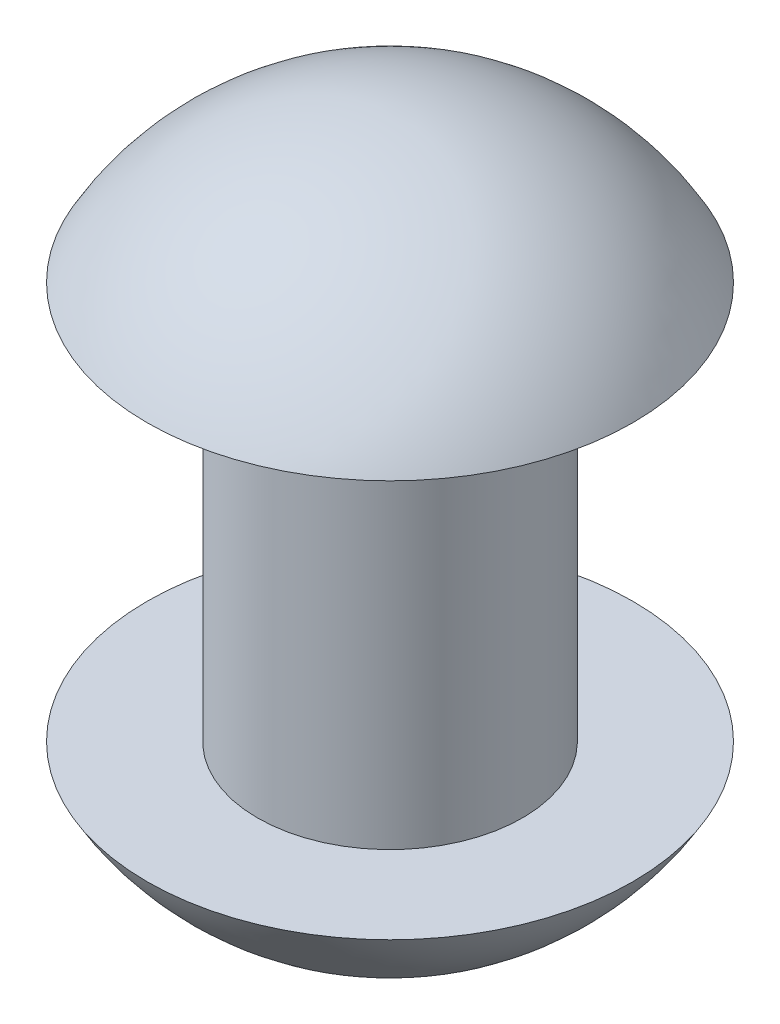
ISO-10303-21;
HEADER;
FILE_DESCRIPTION(('STEP AP214'),'2;1');
FILE_NAME('part.step','',(''),(''),'','','');
FILE_SCHEMA(('AUTOMOTIVE_DESIGN { 1 0 10303 214 1 1 1 1 }'));
ENDSEC;
DATA;
#1=APPLICATION_CONTEXT('core data for automotive mechanical design processes');
#2=APPLICATION_PROTOCOL_DEFINITION('international standard','automotive_design',2000,#1);
#3=PRODUCT_CONTEXT('',#1,'mechanical');
#4=PRODUCT('Part','Part','',(#3));
#5=PRODUCT_RELATED_PRODUCT_CATEGORY('part','',(#4));
#6=PRODUCT_DEFINITION_FORMATION('','',#4);
#7=PRODUCT_DEFINITION_CONTEXT('part definition',#1,'design');
#8=PRODUCT_DEFINITION('design','',#6,#7);
#9=PRODUCT_DEFINITION_SHAPE('','',#8);
#10=(LENGTH_UNIT() NAMED_UNIT(*) SI_UNIT(.MILLI.,.METRE.));
#11=(NAMED_UNIT(*) PLANE_ANGLE_UNIT() SI_UNIT($,.RADIAN.));
#12=(NAMED_UNIT(*) SI_UNIT($,.STERADIAN.) SOLID_ANGLE_UNIT());
#13=UNCERTAINTY_MEASURE_WITH_UNIT(LENGTH_MEASURE(1.E-05),#10,'distance_accuracy_value','');
#14=(GEOMETRIC_REPRESENTATION_CONTEXT(3) GLOBAL_UNCERTAINTY_ASSIGNED_CONTEXT((#13)) GLOBAL_UNIT_ASSIGNED_CONTEXT((#10,
#11,#12)) REPRESENTATION_CONTEXT('',''));
#15=CARTESIAN_POINT('',(0.,0.,0.));
#16=DIRECTION('',(0.,0.,1.));
#17=DIRECTION('',(1.,0.,0.));
#18=AXIS2_PLACEMENT_3D('',#15,#16,#17);
#19=CARTESIAN_POINT('',(-0.12,0.,0.));
#20=DIRECTION('',(0.,1.,0.));
#21=DIRECTION('',(0.,0.,1.));
#22=AXIS2_PLACEMENT_3D('',#19,#20,#21);
#23=PLANE('',#22);
#24=CARTESIAN_POINT('',(0.,0.,0.));
#25=DIRECTION('',(0.,1.,0.));
#26=DIRECTION('',(0.,0.,1.));
#27=AXIS2_PLACEMENT_3D('',#24,#25,#26);
#28=CIRCLE('',#27,0.22);
#29=CARTESIAN_POINT('',(0.,0.,0.22));
#30=VERTEX_POINT('',#29);
#31=EDGE_CURVE('E10',#30,#30,#28,.T.);
#32=ORIENTED_EDGE('',*,*,#31,.T.);
#33=EDGE_LOOP('',(#32));
#34=FACE_BOUND('',#33,.T.);
#35=CARTESIAN_POINT('',(0.,0.,0.));
#36=DIRECTION('',(0.,1.,0.));
#37=DIRECTION('',(0.,0.,1.));
#38=AXIS2_PLACEMENT_3D('',#35,#36,#37);
#39=CIRCLE('',#38,0.12);
#40=CARTESIAN_POINT('',(0.,0.,0.12));
#41=VERTEX_POINT('',#40);
#42=EDGE_CURVE('E45',#41,#41,#39,.T.);
#43=ORIENTED_EDGE('',*,*,#42,.F.);
#44=EDGE_LOOP('',(#43));
#45=FACE_BOUND('',#44,.T.);
#46=ADVANCED_FACE('F31',(#34,#45),#23,.T.);
#47=CARTESIAN_POINT('',(0.,0.123196023754803,0.));
#48=DIRECTION('',(0.,1.,0.));
#49=DIRECTION('',(-1.,0.,0.));
#50=AXIS2_PLACEMENT_3D('',#47,#48,#49);
#51=SPHERICAL_SURFACE('',#50,0.25214531577841);
#52=ORIENTED_EDGE('',*,*,#31,.F.);
#53=EDGE_LOOP('',(#52));
#54=FACE_BOUND('',#53,.T.);
#55=ADVANCED_FACE('F54',(#54),#51,.T.);
#56=CARTESIAN_POINT('',(0.,0.236803976245197,0.));
#57=DIRECTION('',(0.,1.,0.));
#58=DIRECTION('',(-1.,0.,0.));
#59=AXIS2_PLACEMENT_3D('',#56,#57,#58);
#60=SPHERICAL_SURFACE('',#59,0.25214531577841);
#61=CARTESIAN_POINT('',(0.,0.36,0.));
#62=DIRECTION('',(0.,1.,0.));
#63=DIRECTION('',(0.,0.,1.));
#64=AXIS2_PLACEMENT_3D('',#61,#62,#63);
#65=CIRCLE('',#64,0.22);
#66=CARTESIAN_POINT('',(0.,0.36,0.22));
#67=VERTEX_POINT('',#66);
#68=EDGE_CURVE('E37',#67,#67,#65,.T.);
#69=ORIENTED_EDGE('',*,*,#68,.T.);
#70=EDGE_LOOP('',(#69));
#71=FACE_BOUND('',#70,.T.);
#72=ADVANCED_FACE('F58',(#71),#60,.T.);
#73=CARTESIAN_POINT('',(-0.12,0.36,0.));
#74=DIRECTION('',(0.,1.,0.));
#75=DIRECTION('',(0.,0.,1.));
#76=AXIS2_PLACEMENT_3D('',#73,#74,#75);
#77=PLANE('',#76);
#78=ORIENTED_EDGE('',*,*,#68,.F.);
#79=EDGE_LOOP('',(#78));
#80=FACE_BOUND('',#79,.T.);
#81=CARTESIAN_POINT('',(0.,0.36,0.));
#82=DIRECTION('',(0.,1.,0.));
#83=DIRECTION('',(0.,0.,1.));
#84=AXIS2_PLACEMENT_3D('',#81,#82,#83);
#85=CIRCLE('',#84,0.12);
#86=CARTESIAN_POINT('',(0.,0.36,0.12));
#87=VERTEX_POINT('',#86);
#88=EDGE_CURVE('E41',#87,#87,#85,.T.);
#89=ORIENTED_EDGE('',*,*,#88,.T.);
#90=EDGE_LOOP('',(#89));
#91=FACE_BOUND('',#90,.T.);
#92=ADVANCED_FACE('F63',(#80,#91),#77,.F.);
#93=CARTESIAN_POINT('',(0.,0.488949292023607,0.));
#94=DIRECTION('',(0.,1.,0.));
#95=DIRECTION('',(0.,0.,1.));
#96=AXIS2_PLACEMENT_3D('',#93,#94,#95);
#97=CYLINDRICAL_SURFACE('',#96,0.12);
#98=ORIENTED_EDGE('',*,*,#88,.F.);
#99=EDGE_LOOP('',(#98));
#100=FACE_BOUND('',#99,.T.);
#101=ORIENTED_EDGE('',*,*,#42,.T.);
#102=EDGE_LOOP('',(#101));
#103=FACE_BOUND('',#102,.T.);
#104=ADVANCED_FACE('F51',(#100,#103),#97,.T.);
#105=CLOSED_SHELL('',(#46,#55,#72,#92,#104));
#106=MANIFOLD_SOLID_BREP('B2',#105);
#107=ADVANCED_BREP_SHAPE_REPRESENTATION('',(#18,#106),#14);
#108=SHAPE_DEFINITION_REPRESENTATION(#9,#107);
ENDSEC;
END-ISO-10303-21;
